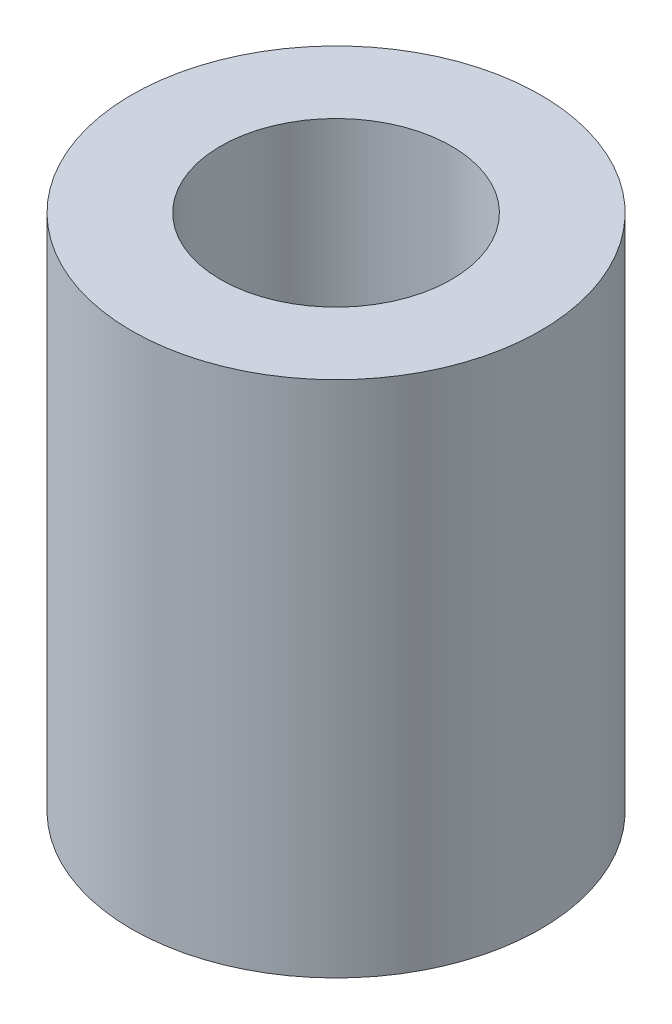
ISO-10303-21;
HEADER;
FILE_DESCRIPTION(('STEP AP214'),'2;1');
FILE_NAME('part.step','',(''),(''),'','','');
FILE_SCHEMA(('AUTOMOTIVE_DESIGN { 1 0 10303 214 1 1 1 1 }'));
ENDSEC;
DATA;
#1=APPLICATION_CONTEXT('core data for automotive mechanical design processes');
#2=APPLICATION_PROTOCOL_DEFINITION('international standard','automotive_design',2000,#1);
#3=PRODUCT_CONTEXT('',#1,'mechanical');
#4=PRODUCT('Part','Part','',(#3));
#5=PRODUCT_RELATED_PRODUCT_CATEGORY('part','',(#4));
#6=PRODUCT_DEFINITION_FORMATION('','',#4);
#7=PRODUCT_DEFINITION_CONTEXT('part definition',#1,'design');
#8=PRODUCT_DEFINITION('design','',#6,#7);
#9=PRODUCT_DEFINITION_SHAPE('','',#8);
#10=(LENGTH_UNIT() NAMED_UNIT(*) SI_UNIT(.MILLI.,.METRE.));
#11=(NAMED_UNIT(*) PLANE_ANGLE_UNIT() SI_UNIT($,.RADIAN.));
#12=(NAMED_UNIT(*) SI_UNIT($,.STERADIAN.) SOLID_ANGLE_UNIT());
#13=UNCERTAINTY_MEASURE_WITH_UNIT(LENGTH_MEASURE(1.E-05),#10,'distance_accuracy_value','');
#14=(GEOMETRIC_REPRESENTATION_CONTEXT(3) GLOBAL_UNCERTAINTY_ASSIGNED_CONTEXT((#13)) GLOBAL_UNIT_ASSIGNED_CONTEXT((#10,
#11,#12)) REPRESENTATION_CONTEXT('',''));
#15=CARTESIAN_POINT('',(0.,0.,0.));
#16=DIRECTION('',(0.,0.,1.));
#17=DIRECTION('',(1.,0.,0.));
#18=AXIS2_PLACEMENT_3D('',#15,#16,#17);
#19=CARTESIAN_POINT('',(0.,14.8082,0.));
#20=DIRECTION('',(0.,1.,0.));
#21=DIRECTION('',(0.,0.,1.));
#22=AXIS2_PLACEMENT_3D('',#19,#20,#21);
#23=PLANE('',#22);
#24=CARTESIAN_POINT('',(0.,14.8082,0.));
#25=DIRECTION('',(0.,1.,0.));
#26=DIRECTION('',(0.,0.,1.));
#27=AXIS2_PLACEMENT_3D('',#24,#25,#26);
#28=CIRCLE('',#27,5.842);
#29=CARTESIAN_POINT('',(0.,14.8082,5.842));
#30=VERTEX_POINT('',#29);
#31=EDGE_CURVE('E10',#30,#30,#28,.T.);
#32=ORIENTED_EDGE('',*,*,#31,.T.);
#33=EDGE_LOOP('',(#32));
#34=FACE_BOUND('',#33,.T.);
#35=CARTESIAN_POINT('',(0.,14.8082,0.));
#36=DIRECTION('',(0.,1.,0.));
#37=DIRECTION('',(0.,0.,1.));
#38=AXIS2_PLACEMENT_3D('',#35,#36,#37);
#39=CIRCLE('',#38,3.302);
#40=CARTESIAN_POINT('',(0.,14.8082,3.302));
#41=VERTEX_POINT('',#40);
#42=EDGE_CURVE('E44',#41,#41,#39,.T.);
#43=ORIENTED_EDGE('',*,*,#42,.F.);
#44=EDGE_LOOP('',(#43));
#45=FACE_BOUND('',#44,.T.);
#46=ADVANCED_FACE('F33',(#34,#45),#23,.T.);
#47=CARTESIAN_POINT('',(0.,0.,0.));
#48=DIRECTION('',(0.,1.,0.));
#49=DIRECTION('',(0.,0.,1.));
#50=AXIS2_PLACEMENT_3D('',#47,#48,#49);
#51=PLANE('',#50);
#52=CARTESIAN_POINT('',(0.,0.,0.));
#53=DIRECTION('',(0.,1.,0.));
#54=DIRECTION('',(0.,0.,1.));
#55=AXIS2_PLACEMENT_3D('',#52,#53,#54);
#56=CIRCLE('',#55,5.842);
#57=CARTESIAN_POINT('',(0.,0.,5.842));
#58=VERTEX_POINT('',#57);
#59=EDGE_CURVE('E37',#58,#58,#56,.T.);
#60=ORIENTED_EDGE('',*,*,#59,.F.);
#61=EDGE_LOOP('',(#60));
#62=FACE_BOUND('',#61,.T.);
#63=CARTESIAN_POINT('',(0.,0.,0.));
#64=DIRECTION('',(0.,1.,0.));
#65=DIRECTION('',(0.,0.,1.));
#66=AXIS2_PLACEMENT_3D('',#63,#64,#65);
#67=CIRCLE('',#66,3.302);
#68=CARTESIAN_POINT('',(0.,0.,3.302));
#69=VERTEX_POINT('',#68);
#70=EDGE_CURVE('E46',#69,#69,#67,.T.);
#71=ORIENTED_EDGE('',*,*,#70,.T.);
#72=EDGE_LOOP('',(#71));
#73=FACE_BOUND('',#72,.T.);
#74=ADVANCED_FACE('F56',(#62,#73),#51,.F.);
#75=CARTESIAN_POINT('',(0.,14.8082,0.));
#76=DIRECTION('',(0.,-1.,0.));
#77=DIRECTION('',(0.,0.,-1.));
#78=AXIS2_PLACEMENT_3D('',#75,#76,#77);
#79=CYLINDRICAL_SURFACE('',#78,5.842);
#80=ORIENTED_EDGE('',*,*,#31,.F.);
#81=EDGE_LOOP('',(#80));
#82=FACE_BOUND('',#81,.T.);
#83=ORIENTED_EDGE('',*,*,#59,.T.);
#84=EDGE_LOOP('',(#83));
#85=FACE_BOUND('',#84,.T.);
#86=ADVANCED_FACE('F35',(#82,#85),#79,.T.);
#87=CARTESIAN_POINT('',(0.,14.8082,0.));
#88=DIRECTION('',(0.,-1.,0.));
#89=DIRECTION('',(0.,0.,-1.));
#90=AXIS2_PLACEMENT_3D('',#87,#88,#89);
#91=CYLINDRICAL_SURFACE('',#90,3.302);
#92=ORIENTED_EDGE('',*,*,#42,.T.);
#93=EDGE_LOOP('',(#92));
#94=FACE_BOUND('',#93,.T.);
#95=ORIENTED_EDGE('',*,*,#70,.F.);
#96=EDGE_LOOP('',(#95));
#97=FACE_BOUND('',#96,.T.);
#98=ADVANCED_FACE('F52',(#94,#97),#91,.F.);
#99=CLOSED_SHELL('',(#46,#74,#86,#98));
#100=MANIFOLD_SOLID_BREP('B2',#99);
#101=ADVANCED_BREP_SHAPE_REPRESENTATION('',(#18,#100),#14);
#102=SHAPE_DEFINITION_REPRESENTATION(#9,#101);
ENDSEC;
END-ISO-10303-21;
